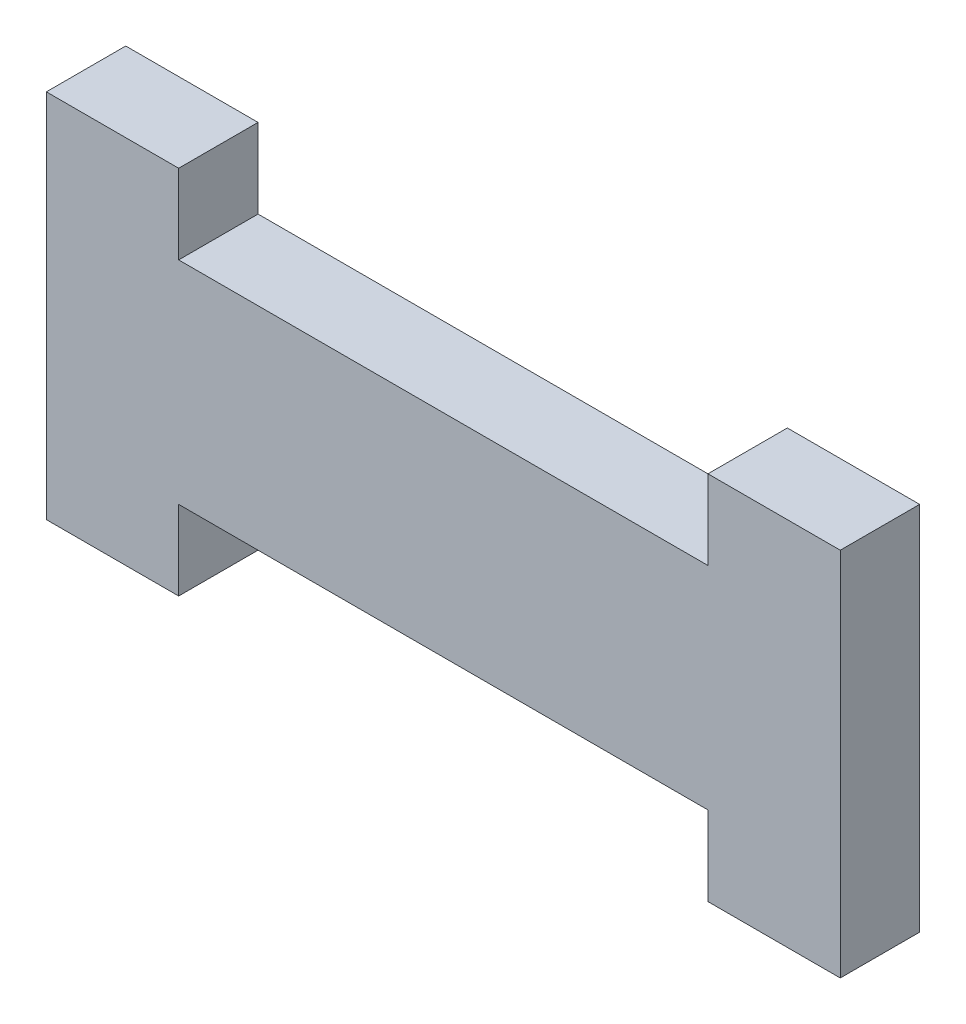
ISO-10303-21;
HEADER;
FILE_DESCRIPTION(('STEP AP214'),'2;1');
FILE_NAME('part.step','',(''),(''),'','','');
FILE_SCHEMA(('AUTOMOTIVE_DESIGN { 1 0 10303 214 1 1 1 1 }'));
ENDSEC;
DATA;
#1=APPLICATION_CONTEXT('core data for automotive mechanical design processes');
#2=APPLICATION_PROTOCOL_DEFINITION('international standard','automotive_design',2000,#1);
#3=PRODUCT_CONTEXT('',#1,'mechanical');
#4=PRODUCT('Part','Part','',(#3));
#5=PRODUCT_RELATED_PRODUCT_CATEGORY('part','',(#4));
#6=PRODUCT_DEFINITION_FORMATION('','',#4);
#7=PRODUCT_DEFINITION_CONTEXT('part definition',#1,'design');
#8=PRODUCT_DEFINITION('design','',#6,#7);
#9=PRODUCT_DEFINITION_SHAPE('','',#8);
#10=(LENGTH_UNIT() NAMED_UNIT(*) SI_UNIT(.MILLI.,.METRE.));
#11=(NAMED_UNIT(*) PLANE_ANGLE_UNIT() SI_UNIT($,.RADIAN.));
#12=(NAMED_UNIT(*) SI_UNIT($,.STERADIAN.) SOLID_ANGLE_UNIT());
#13=UNCERTAINTY_MEASURE_WITH_UNIT(LENGTH_MEASURE(1.E-05),#10,'distance_accuracy_value','');
#14=(GEOMETRIC_REPRESENTATION_CONTEXT(3) GLOBAL_UNCERTAINTY_ASSIGNED_CONTEXT((#13)) GLOBAL_UNIT_ASSIGNED_CONTEXT((#10,
#11,#12)) REPRESENTATION_CONTEXT('',''));
#15=CARTESIAN_POINT('',(0.,0.,0.));
#16=DIRECTION('',(0.,0.,1.));
#17=DIRECTION('',(1.,0.,0.));
#18=AXIS2_PLACEMENT_3D('',#15,#16,#17);
#19=CARTESIAN_POINT('',(0.,0.,6.));
#20=DIRECTION('',(1.,0.,0.));
#21=DIRECTION('',(0.,0.,-1.));
#22=AXIS2_PLACEMENT_3D('',#19,#20,#21);
#23=PLANE('',#22);
#24=DIRECTION('',(0.,-1.,0.));
#25=VECTOR('',#24,1.);
#26=CARTESIAN_POINT('',(0.,0.,0.));
#27=LINE('',#26,#25);
#28=CARTESIAN_POINT('',(0.,28.,0.));
#29=VERTEX_POINT('',#28);
#30=CARTESIAN_POINT('',(0.,0.,0.));
#31=VERTEX_POINT('',#30);
#32=EDGE_CURVE('E155',#29,#31,#27,.T.);
#33=ORIENTED_EDGE('',*,*,#32,.T.);
#34=DIRECTION('',(0.,0.,-1.));
#35=VECTOR('',#34,1.);
#36=CARTESIAN_POINT('',(0.,0.,6.));
#37=LINE('',#36,#35);
#38=CARTESIAN_POINT('',(0.,0.,6.));
#39=VERTEX_POINT('',#38);
#40=EDGE_CURVE('E11',#39,#31,#37,.T.);
#41=ORIENTED_EDGE('',*,*,#40,.F.);
#42=DIRECTION('',(0.,-1.,0.));
#43=VECTOR('',#42,1.);
#44=CARTESIAN_POINT('',(0.,0.,6.));
#45=LINE('',#44,#43);
#46=CARTESIAN_POINT('',(0.,28.,6.));
#47=VERTEX_POINT('',#46);
#48=EDGE_CURVE('E177',#47,#39,#45,.T.);
#49=ORIENTED_EDGE('',*,*,#48,.F.);
#50=DIRECTION('',(0.,0.,-1.));
#51=VECTOR('',#50,1.);
#52=CARTESIAN_POINT('',(0.,28.,6.));
#53=LINE('',#52,#51);
#54=EDGE_CURVE('E151',#47,#29,#53,.T.);
#55=ORIENTED_EDGE('',*,*,#54,.T.);
#56=EDGE_LOOP('',(#33,#41,#49,#55));
#57=FACE_BOUND('',#56,.T.);
#58=ADVANCED_FACE('F35',(#57),#23,.F.);
#59=CARTESIAN_POINT('',(0.,0.,6.));
#60=DIRECTION('',(0.,1.,0.));
#61=DIRECTION('',(0.,0.,1.));
#62=AXIS2_PLACEMENT_3D('',#59,#60,#61);
#63=PLANE('',#62);
#64=DIRECTION('',(1.,0.,0.));
#65=VECTOR('',#64,1.);
#66=CARTESIAN_POINT('',(0.,0.,0.));
#67=LINE('',#66,#65);
#68=CARTESIAN_POINT('',(10.,0.,0.));
#69=VERTEX_POINT('',#68);
#70=EDGE_CURVE('E158',#31,#69,#67,.T.);
#71=ORIENTED_EDGE('',*,*,#70,.T.);
#72=DIRECTION('',(0.,0.,-1.));
#73=VECTOR('',#72,1.);
#74=CARTESIAN_POINT('',(10.,0.,6.));
#75=LINE('',#74,#73);
#76=CARTESIAN_POINT('',(10.,0.,6.));
#77=VERTEX_POINT('',#76);
#78=EDGE_CURVE('E43',#77,#69,#75,.T.);
#79=ORIENTED_EDGE('',*,*,#78,.F.);
#80=DIRECTION('',(1.,0.,0.));
#81=VECTOR('',#80,1.);
#82=CARTESIAN_POINT('',(0.,0.,6.));
#83=LINE('',#82,#81);
#84=EDGE_CURVE('E106',#39,#77,#83,.T.);
#85=ORIENTED_EDGE('',*,*,#84,.F.);
#86=ORIENTED_EDGE('',*,*,#40,.T.);
#87=EDGE_LOOP('',(#71,#79,#85,#86));
#88=FACE_BOUND('',#87,.T.);
#89=ADVANCED_FACE('F255',(#88),#63,.F.);
#90=CARTESIAN_POINT('',(10.,0.,6.));
#91=DIRECTION('',(-1.,0.,0.));
#92=DIRECTION('',(0.,0.,1.));
#93=AXIS2_PLACEMENT_3D('',#90,#91,#92);
#94=PLANE('',#93);
#95=DIRECTION('',(0.,1.,0.));
#96=VECTOR('',#95,1.);
#97=CARTESIAN_POINT('',(10.,0.,0.));
#98=LINE('',#97,#96);
#99=CARTESIAN_POINT('',(10.,6.,0.));
#100=VERTEX_POINT('',#99);
#101=EDGE_CURVE('E160',#69,#100,#98,.T.);
#102=ORIENTED_EDGE('',*,*,#101,.T.);
#103=DIRECTION('',(0.,0.,-1.));
#104=VECTOR('',#103,1.);
#105=CARTESIAN_POINT('',(10.,6.,6.));
#106=LINE('',#105,#104);
#107=CARTESIAN_POINT('',(10.,6.,6.));
#108=VERTEX_POINT('',#107);
#109=EDGE_CURVE('E196',#108,#100,#106,.T.);
#110=ORIENTED_EDGE('',*,*,#109,.F.);
#111=DIRECTION('',(0.,1.,0.));
#112=VECTOR('',#111,1.);
#113=CARTESIAN_POINT('',(10.,0.,6.));
#114=LINE('',#113,#112);
#115=EDGE_CURVE('E204',#77,#108,#114,.T.);
#116=ORIENTED_EDGE('',*,*,#115,.F.);
#117=ORIENTED_EDGE('',*,*,#78,.T.);
#118=EDGE_LOOP('',(#102,#110,#116,#117));
#119=FACE_BOUND('',#118,.T.);
#120=ADVANCED_FACE('F202',(#119),#94,.F.);
#121=CARTESIAN_POINT('',(10.,6.,6.));
#122=DIRECTION('',(0.,1.,0.));
#123=DIRECTION('',(0.,0.,1.));
#124=AXIS2_PLACEMENT_3D('',#121,#122,#123);
#125=PLANE('',#124);
#126=DIRECTION('',(1.,0.,0.));
#127=VECTOR('',#126,1.);
#128=CARTESIAN_POINT('',(10.,6.,0.));
#129=LINE('',#128,#127);
#130=CARTESIAN_POINT('',(50.,6.,0.));
#131=VERTEX_POINT('',#130);
#132=EDGE_CURVE('E162',#100,#131,#129,.T.);
#133=ORIENTED_EDGE('',*,*,#132,.T.);
#134=DIRECTION('',(0.,0.,-1.));
#135=VECTOR('',#134,1.);
#136=CARTESIAN_POINT('',(50.,6.,6.));
#137=LINE('',#136,#135);
#138=CARTESIAN_POINT('',(50.,6.,6.));
#139=VERTEX_POINT('',#138);
#140=EDGE_CURVE('E193',#139,#131,#137,.T.);
#141=ORIENTED_EDGE('',*,*,#140,.F.);
#142=DIRECTION('',(1.,0.,0.));
#143=VECTOR('',#142,1.);
#144=CARTESIAN_POINT('',(10.,6.,6.));
#145=LINE('',#144,#143);
#146=EDGE_CURVE('E222',#108,#139,#145,.T.);
#147=ORIENTED_EDGE('',*,*,#146,.F.);
#148=ORIENTED_EDGE('',*,*,#109,.T.);
#149=EDGE_LOOP('',(#133,#141,#147,#148));
#150=FACE_BOUND('',#149,.T.);
#151=ADVANCED_FACE('F213',(#150),#125,.F.);
#152=CARTESIAN_POINT('',(50.,0.,6.));
#153=DIRECTION('',(1.,0.,0.));
#154=DIRECTION('',(0.,0.,-1.));
#155=AXIS2_PLACEMENT_3D('',#152,#153,#154);
#156=PLANE('',#155);
#157=DIRECTION('',(0.,-1.,0.));
#158=VECTOR('',#157,1.);
#159=CARTESIAN_POINT('',(50.,0.,0.));
#160=LINE('',#159,#158);
#161=CARTESIAN_POINT('',(50.,0.,0.));
#162=VERTEX_POINT('',#161);
#163=EDGE_CURVE('E164',#131,#162,#160,.T.);
#164=ORIENTED_EDGE('',*,*,#163,.T.);
#165=DIRECTION('',(0.,0.,-1.));
#166=VECTOR('',#165,1.);
#167=CARTESIAN_POINT('',(50.,0.,6.));
#168=LINE('',#167,#166);
#169=CARTESIAN_POINT('',(50.,0.,6.));
#170=VERTEX_POINT('',#169);
#171=EDGE_CURVE('E190',#170,#162,#168,.T.);
#172=ORIENTED_EDGE('',*,*,#171,.F.);
#173=DIRECTION('',(0.,-1.,0.));
#174=VECTOR('',#173,1.);
#175=CARTESIAN_POINT('',(50.,0.,6.));
#176=LINE('',#175,#174);
#177=EDGE_CURVE('E219',#139,#170,#176,.T.);
#178=ORIENTED_EDGE('',*,*,#177,.F.);
#179=ORIENTED_EDGE('',*,*,#140,.T.);
#180=EDGE_LOOP('',(#164,#172,#178,#179));
#181=FACE_BOUND('',#180,.T.);
#182=ADVANCED_FACE('F217',(#181),#156,.F.);
#183=CARTESIAN_POINT('',(50.,0.,6.));
#184=DIRECTION('',(0.,1.,0.));
#185=DIRECTION('',(0.,0.,1.));
#186=AXIS2_PLACEMENT_3D('',#183,#184,#185);
#187=PLANE('',#186);
#188=DIRECTION('',(1.,0.,0.));
#189=VECTOR('',#188,1.);
#190=CARTESIAN_POINT('',(50.,0.,0.));
#191=LINE('',#190,#189);
#192=CARTESIAN_POINT('',(60.,0.,0.));
#193=VERTEX_POINT('',#192);
#194=EDGE_CURVE('E166',#162,#193,#191,.T.);
#195=ORIENTED_EDGE('',*,*,#194,.T.);
#196=DIRECTION('',(0.,0.,-1.));
#197=VECTOR('',#196,1.);
#198=CARTESIAN_POINT('',(60.,0.,6.));
#199=LINE('',#198,#197);
#200=CARTESIAN_POINT('',(60.,0.,6.));
#201=VERTEX_POINT('',#200);
#202=EDGE_CURVE('E187',#201,#193,#199,.T.);
#203=ORIENTED_EDGE('',*,*,#202,.F.);
#204=DIRECTION('',(1.,0.,0.));
#205=VECTOR('',#204,1.);
#206=CARTESIAN_POINT('',(50.,0.,6.));
#207=LINE('',#206,#205);
#208=EDGE_CURVE('E221',#170,#201,#207,.T.);
#209=ORIENTED_EDGE('',*,*,#208,.F.);
#210=ORIENTED_EDGE('',*,*,#171,.T.);
#211=EDGE_LOOP('',(#195,#203,#209,#210));
#212=FACE_BOUND('',#211,.T.);
#213=ADVANCED_FACE('F268',(#212),#187,.F.);
#214=CARTESIAN_POINT('',(60.,0.,6.));
#215=DIRECTION('',(-1.,0.,0.));
#216=DIRECTION('',(0.,-1.,0.));
#217=AXIS2_PLACEMENT_3D('',#214,#215,#216);
#218=PLANE('',#217);
#219=DIRECTION('',(0.,1.,0.));
#220=VECTOR('',#219,1.);
#221=CARTESIAN_POINT('',(60.,0.,0.));
#222=LINE('',#221,#220);
#223=CARTESIAN_POINT('',(60.,28.,0.));
#224=VERTEX_POINT('',#223);
#225=EDGE_CURVE('E168',#193,#224,#222,.T.);
#226=ORIENTED_EDGE('',*,*,#225,.T.);
#227=DIRECTION('',(0.,0.,-1.));
#228=VECTOR('',#227,1.);
#229=CARTESIAN_POINT('',(60.,28.,6.));
#230=LINE('',#229,#228);
#231=CARTESIAN_POINT('',(60.,28.,6.));
#232=VERTEX_POINT('',#231);
#233=EDGE_CURVE('E184',#232,#224,#230,.T.);
#234=ORIENTED_EDGE('',*,*,#233,.F.);
#235=DIRECTION('',(0.,1.,0.));
#236=VECTOR('',#235,1.);
#237=CARTESIAN_POINT('',(60.,0.,6.));
#238=LINE('',#237,#236);
#239=EDGE_CURVE('E224',#201,#232,#238,.T.);
#240=ORIENTED_EDGE('',*,*,#239,.F.);
#241=ORIENTED_EDGE('',*,*,#202,.T.);
#242=EDGE_LOOP('',(#226,#234,#240,#241));
#243=FACE_BOUND('',#242,.T.);
#244=ADVANCED_FACE('F271',(#243),#218,.F.);
#245=CARTESIAN_POINT('',(50.,28.,6.));
#246=DIRECTION('',(0.,-1.,0.));
#247=DIRECTION('',(1.,0.,0.));
#248=AXIS2_PLACEMENT_3D('',#245,#246,#247);
#249=PLANE('',#248);
#250=DIRECTION('',(-1.,0.,0.));
#251=VECTOR('',#250,1.);
#252=CARTESIAN_POINT('',(50.,28.,0.));
#253=LINE('',#252,#251);
#254=CARTESIAN_POINT('',(50.,28.,0.));
#255=VERTEX_POINT('',#254);
#256=EDGE_CURVE('E170',#224,#255,#253,.T.);
#257=ORIENTED_EDGE('',*,*,#256,.T.);
#258=DIRECTION('',(0.,0.,-1.));
#259=VECTOR('',#258,1.);
#260=CARTESIAN_POINT('',(50.,28.,6.));
#261=LINE('',#260,#259);
#262=CARTESIAN_POINT('',(50.,28.,6.));
#263=VERTEX_POINT('',#262);
#264=EDGE_CURVE('E181',#263,#255,#261,.T.);
#265=ORIENTED_EDGE('',*,*,#264,.F.);
#266=DIRECTION('',(-1.,0.,0.));
#267=VECTOR('',#266,1.);
#268=CARTESIAN_POINT('',(50.,28.,6.));
#269=LINE('',#268,#267);
#270=EDGE_CURVE('E230',#232,#263,#269,.T.);
#271=ORIENTED_EDGE('',*,*,#270,.F.);
#272=ORIENTED_EDGE('',*,*,#233,.T.);
#273=EDGE_LOOP('',(#257,#265,#271,#272));
#274=FACE_BOUND('',#273,.T.);
#275=ADVANCED_FACE('F236',(#274),#249,.F.);
#276=CARTESIAN_POINT('',(50.,28.,6.));
#277=DIRECTION('',(1.,0.,0.));
#278=DIRECTION('',(0.,0.,-1.));
#279=AXIS2_PLACEMENT_3D('',#276,#277,#278);
#280=PLANE('',#279);
#281=DIRECTION('',(0.,-1.,0.));
#282=VECTOR('',#281,1.);
#283=CARTESIAN_POINT('',(50.,28.,0.));
#284=LINE('',#283,#282);
#285=CARTESIAN_POINT('',(50.,22.,0.));
#286=VERTEX_POINT('',#285);
#287=EDGE_CURVE('E172',#255,#286,#284,.T.);
#288=ORIENTED_EDGE('',*,*,#287,.T.);
#289=DIRECTION('',(0.,0.,-1.));
#290=VECTOR('',#289,1.);
#291=CARTESIAN_POINT('',(50.,22.,6.));
#292=LINE('',#291,#290);
#293=CARTESIAN_POINT('',(50.,22.,6.));
#294=VERTEX_POINT('',#293);
#295=EDGE_CURVE('E146',#294,#286,#292,.T.);
#296=ORIENTED_EDGE('',*,*,#295,.F.);
#297=DIRECTION('',(0.,-1.,0.));
#298=VECTOR('',#297,1.);
#299=CARTESIAN_POINT('',(50.,28.,6.));
#300=LINE('',#299,#298);
#301=EDGE_CURVE('E137',#263,#294,#300,.T.);
#302=ORIENTED_EDGE('',*,*,#301,.F.);
#303=ORIENTED_EDGE('',*,*,#264,.T.);
#304=EDGE_LOOP('',(#288,#296,#302,#303));
#305=FACE_BOUND('',#304,.T.);
#306=ADVANCED_FACE('F240',(#305),#280,.F.);
#307=CARTESIAN_POINT('',(10.,22.,6.));
#308=DIRECTION('',(0.,-1.,0.));
#309=DIRECTION('',(0.,0.,-1.));
#310=AXIS2_PLACEMENT_3D('',#307,#308,#309);
#311=PLANE('',#310);
#312=DIRECTION('',(-1.,0.,0.));
#313=VECTOR('',#312,1.);
#314=CARTESIAN_POINT('',(10.,22.,0.));
#315=LINE('',#314,#313);
#316=CARTESIAN_POINT('',(10.,22.,0.));
#317=VERTEX_POINT('',#316);
#318=EDGE_CURVE('E145',#286,#317,#315,.T.);
#319=ORIENTED_EDGE('',*,*,#318,.T.);
#320=DIRECTION('',(0.,0.,-1.));
#321=VECTOR('',#320,1.);
#322=CARTESIAN_POINT('',(10.,22.,6.));
#323=LINE('',#322,#321);
#324=CARTESIAN_POINT('',(10.,22.,6.));
#325=VERTEX_POINT('',#324);
#326=EDGE_CURVE('E142',#325,#317,#323,.T.);
#327=ORIENTED_EDGE('',*,*,#326,.F.);
#328=DIRECTION('',(-1.,0.,0.));
#329=VECTOR('',#328,1.);
#330=CARTESIAN_POINT('',(10.,22.,6.));
#331=LINE('',#330,#329);
#332=EDGE_CURVE('E131',#294,#325,#331,.T.);
#333=ORIENTED_EDGE('',*,*,#332,.F.);
#334=ORIENTED_EDGE('',*,*,#295,.T.);
#335=EDGE_LOOP('',(#319,#327,#333,#334));
#336=FACE_BOUND('',#335,.T.);
#337=ADVANCED_FACE('F143',(#336),#311,.F.);
#338=CARTESIAN_POINT('',(10.,28.,6.));
#339=DIRECTION('',(-1.,0.,0.));
#340=DIRECTION('',(0.,0.,1.));
#341=AXIS2_PLACEMENT_3D('',#338,#339,#340);
#342=PLANE('',#341);
#343=DIRECTION('',(0.,1.,0.));
#344=VECTOR('',#343,1.);
#345=CARTESIAN_POINT('',(10.,28.,0.));
#346=LINE('',#345,#344);
#347=CARTESIAN_POINT('',(10.,28.,0.));
#348=VERTEX_POINT('',#347);
#349=EDGE_CURVE('E92',#317,#348,#346,.T.);
#350=ORIENTED_EDGE('',*,*,#349,.T.);
#351=DIRECTION('',(0.,0.,-1.));
#352=VECTOR('',#351,1.);
#353=CARTESIAN_POINT('',(10.,28.,6.));
#354=LINE('',#353,#352);
#355=CARTESIAN_POINT('',(10.,28.,6.));
#356=VERTEX_POINT('',#355);
#357=EDGE_CURVE('E147',#356,#348,#354,.T.);
#358=ORIENTED_EDGE('',*,*,#357,.F.);
#359=DIRECTION('',(0.,1.,0.));
#360=VECTOR('',#359,1.);
#361=CARTESIAN_POINT('',(10.,28.,6.));
#362=LINE('',#361,#360);
#363=EDGE_CURVE('E135',#325,#356,#362,.T.);
#364=ORIENTED_EDGE('',*,*,#363,.F.);
#365=ORIENTED_EDGE('',*,*,#326,.T.);
#366=EDGE_LOOP('',(#350,#358,#364,#365));
#367=FACE_BOUND('',#366,.T.);
#368=ADVANCED_FACE('F149',(#367),#342,.F.);
#369=CARTESIAN_POINT('',(0.,28.,6.));
#370=DIRECTION('',(0.,-1.,0.));
#371=DIRECTION('',(0.,0.,-1.));
#372=AXIS2_PLACEMENT_3D('',#369,#370,#371);
#373=PLANE('',#372);
#374=DIRECTION('',(-1.,0.,0.));
#375=VECTOR('',#374,1.);
#376=CARTESIAN_POINT('',(0.,28.,0.));
#377=LINE('',#376,#375);
#378=EDGE_CURVE('E98',#348,#29,#377,.T.);
#379=ORIENTED_EDGE('',*,*,#378,.T.);
#380=ORIENTED_EDGE('',*,*,#54,.F.);
#381=DIRECTION('',(-1.,0.,0.));
#382=VECTOR('',#381,1.);
#383=CARTESIAN_POINT('',(0.,28.,6.));
#384=LINE('',#383,#382);
#385=EDGE_CURVE('E51',#356,#47,#384,.T.);
#386=ORIENTED_EDGE('',*,*,#385,.F.);
#387=ORIENTED_EDGE('',*,*,#357,.T.);
#388=EDGE_LOOP('',(#379,#380,#386,#387));
#389=FACE_BOUND('',#388,.T.);
#390=ADVANCED_FACE('F244',(#389),#373,.F.);
#391=CARTESIAN_POINT('',(0.,0.,6.));
#392=DIRECTION('',(0.,0.,-1.));
#393=DIRECTION('',(-1.,0.,0.));
#394=AXIS2_PLACEMENT_3D('',#391,#392,#393);
#395=PLANE('',#394);
#396=ORIENTED_EDGE('',*,*,#48,.T.);
#397=ORIENTED_EDGE('',*,*,#84,.T.);
#398=ORIENTED_EDGE('',*,*,#115,.T.);
#399=ORIENTED_EDGE('',*,*,#146,.T.);
#400=ORIENTED_EDGE('',*,*,#177,.T.);
#401=ORIENTED_EDGE('',*,*,#208,.T.);
#402=ORIENTED_EDGE('',*,*,#239,.T.);
#403=ORIENTED_EDGE('',*,*,#270,.T.);
#404=ORIENTED_EDGE('',*,*,#301,.T.);
#405=ORIENTED_EDGE('',*,*,#332,.T.);
#406=ORIENTED_EDGE('',*,*,#363,.T.);
#407=ORIENTED_EDGE('',*,*,#385,.T.);
#408=EDGE_LOOP('',(#396,#397,#398,#399,#400,#401,#402,#403,#404,#405,#406,#407));
#409=FACE_BOUND('',#408,.T.);
#410=ADVANCED_FACE('F133',(#409),#395,.F.);
#411=CARTESIAN_POINT('',(0.,0.,0.));
#412=DIRECTION('',(0.,0.,-1.));
#413=DIRECTION('',(-1.,0.,0.));
#414=AXIS2_PLACEMENT_3D('',#411,#412,#413);
#415=PLANE('',#414);
#416=ORIENTED_EDGE('',*,*,#32,.F.);
#417=ORIENTED_EDGE('',*,*,#378,.F.);
#418=ORIENTED_EDGE('',*,*,#349,.F.);
#419=ORIENTED_EDGE('',*,*,#318,.F.);
#420=ORIENTED_EDGE('',*,*,#287,.F.);
#421=ORIENTED_EDGE('',*,*,#256,.F.);
#422=ORIENTED_EDGE('',*,*,#225,.F.);
#423=ORIENTED_EDGE('',*,*,#194,.F.);
#424=ORIENTED_EDGE('',*,*,#163,.F.);
#425=ORIENTED_EDGE('',*,*,#132,.F.);
#426=ORIENTED_EDGE('',*,*,#101,.F.);
#427=ORIENTED_EDGE('',*,*,#70,.F.);
#428=EDGE_LOOP('',(#416,#417,#418,#419,#420,#421,#422,#423,#424,#425,#426,#427));
#429=FACE_BOUND('',#428,.T.);
#430=ADVANCED_FACE('F208',(#429),#415,.T.);
#431=CLOSED_SHELL('',(#58,#89,#120,#151,#182,#213,#244,#275,#306,#337,#368,#390,#410,#430));
#432=MANIFOLD_SOLID_BREP('B2',#431);
#433=ADVANCED_BREP_SHAPE_REPRESENTATION('',(#18,#432),#14);
#434=SHAPE_DEFINITION_REPRESENTATION(#9,#433);
ENDSEC;
END-ISO-10303-21;
